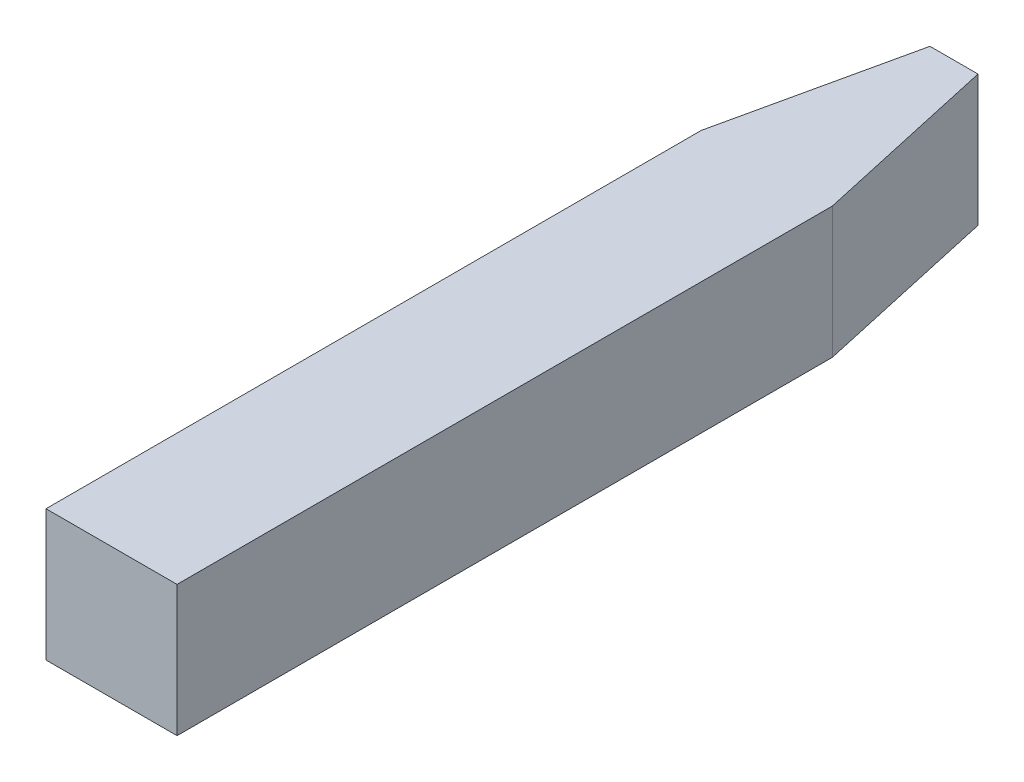
ISO-10303-21;
HEADER;
FILE_DESCRIPTION(('STEP AP214'),'2;1');
FILE_NAME('part.step','',(''),(''),'','','');
FILE_SCHEMA(('AUTOMOTIVE_DESIGN { 1 0 10303 214 1 1 1 1 }'));
ENDSEC;
DATA;
#1=APPLICATION_CONTEXT('core data for automotive mechanical design processes');
#2=APPLICATION_PROTOCOL_DEFINITION('international standard','automotive_design',2000,#1);
#3=PRODUCT_CONTEXT('',#1,'mechanical');
#4=PRODUCT('Part','Part','',(#3));
#5=PRODUCT_RELATED_PRODUCT_CATEGORY('part','',(#4));
#6=PRODUCT_DEFINITION_FORMATION('','',#4);
#7=PRODUCT_DEFINITION_CONTEXT('part definition',#1,'design');
#8=PRODUCT_DEFINITION('design','',#6,#7);
#9=PRODUCT_DEFINITION_SHAPE('','',#8);
#10=(LENGTH_UNIT() NAMED_UNIT(*) SI_UNIT(.MILLI.,.METRE.));
#11=(NAMED_UNIT(*) PLANE_ANGLE_UNIT() SI_UNIT($,.RADIAN.));
#12=(NAMED_UNIT(*) SI_UNIT($,.STERADIAN.) SOLID_ANGLE_UNIT());
#13=UNCERTAINTY_MEASURE_WITH_UNIT(LENGTH_MEASURE(1.E-05),#10,'distance_accuracy_value','');
#14=(GEOMETRIC_REPRESENTATION_CONTEXT(3) GLOBAL_UNCERTAINTY_ASSIGNED_CONTEXT((#13)) GLOBAL_UNIT_ASSIGNED_CONTEXT((#10,
#11,#12)) REPRESENTATION_CONTEXT('',''));
#15=CARTESIAN_POINT('',(0.,0.,0.));
#16=DIRECTION('',(0.,0.,1.));
#17=DIRECTION('',(1.,0.,0.));
#18=AXIS2_PLACEMENT_3D('',#15,#16,#17);
#19=CARTESIAN_POINT('',(1.46249685,2.68042,-3.61250314999995));
#20=DIRECTION('',(0.,1.,0.));
#21=DIRECTION('',(0.,0.,-1.));
#22=AXIS2_PLACEMENT_3D('',#19,#20,#21);
#23=PLANE('',#22);
#24=DIRECTION('',(-1.,0.,0.));
#25=VECTOR('',#24,1.);
#26=CARTESIAN_POINT('',(2.18,2.68042,0.999999999999105));
#27=LINE('',#26,#25);
#28=CARTESIAN_POINT('',(2.18,2.68042,0.999999999999104));
#29=VERTEX_POINT('',#28);
#30=CARTESIAN_POINT('',(1.48,2.68042,0.999999999999104));
#31=VERTEX_POINT('',#30);
#32=EDGE_CURVE('E26',#29,#31,#27,.T.);
#33=ORIENTED_EDGE('',*,*,#32,.F.);
#34=DIRECTION('',(0.,0.,1.));
#35=VECTOR('',#34,1.);
#36=CARTESIAN_POINT('',(2.18,2.68042,-2.5));
#37=LINE('',#36,#35);
#38=CARTESIAN_POINT('',(2.18,2.68042,-2.5));
#39=VERTEX_POINT('',#38);
#40=EDGE_CURVE('E131',#39,#29,#37,.T.);
#41=ORIENTED_EDGE('',*,*,#40,.F.);
#42=DIRECTION('',(0.216439613938066,0.,0.976296007119942));
#43=VECTOR('',#42,1.);
#44=CARTESIAN_POINT('',(1.95830533735709,2.68042,-3.5));
#45=LINE('',#44,#43);
#46=CARTESIAN_POINT('',(1.95830533735709,2.68042,-3.5));
#47=VERTEX_POINT('',#46);
#48=EDGE_CURVE('E118',#47,#39,#45,.T.);
#49=ORIENTED_EDGE('',*,*,#48,.F.);
#50=DIRECTION('',(1.,0.,0.));
#51=VECTOR('',#50,1.);
#52=CARTESIAN_POINT('',(1.70169466264301,2.68042,-3.5));
#53=LINE('',#52,#51);
#54=CARTESIAN_POINT('',(1.70169466264301,2.68042,-3.5));
#55=VERTEX_POINT('',#54);
#56=EDGE_CURVE('E154',#55,#47,#53,.T.);
#57=ORIENTED_EDGE('',*,*,#56,.F.);
#58=DIRECTION('',(0.216439613938066,0.,-0.976296007119942));
#59=VECTOR('',#58,1.);
#60=CARTESIAN_POINT('',(1.48,2.68042,-2.5));
#61=LINE('',#60,#59);
#62=CARTESIAN_POINT('',(1.48,2.68042,-2.5));
#63=VERTEX_POINT('',#62);
#64=EDGE_CURVE('E143',#63,#55,#61,.T.);
#65=ORIENTED_EDGE('',*,*,#64,.F.);
#66=DIRECTION('',(0.,0.,-1.));
#67=VECTOR('',#66,1.);
#68=CARTESIAN_POINT('',(1.48,2.68042,0.999999999999104));
#69=LINE('',#68,#67);
#70=EDGE_CURVE('E114',#31,#63,#69,.T.);
#71=ORIENTED_EDGE('',*,*,#70,.F.);
#72=EDGE_LOOP('',(#33,#41,#49,#57,#65,#71));
#73=FACE_BOUND('',#72,.T.);
#74=ADVANCED_FACE('F16',(#73),#23,.T.);
#75=CARTESIAN_POINT('',(1.46249685,1.98042,1.11250314999908));
#76=DIRECTION('',(0.,-1.,0.));
#77=DIRECTION('',(-1.,0.,0.));
#78=AXIS2_PLACEMENT_3D('',#75,#76,#77);
#79=PLANE('',#78);
#80=DIRECTION('',(-0.216439613938066,0.,0.976296007119942));
#81=VECTOR('',#80,1.);
#82=CARTESIAN_POINT('',(1.7016946626429,1.98042,-3.5));
#83=LINE('',#82,#81);
#84=CARTESIAN_POINT('',(1.70169466264301,1.98042,-3.5));
#85=VERTEX_POINT('',#84);
#86=CARTESIAN_POINT('',(1.48,1.98042,-2.5));
#87=VERTEX_POINT('',#86);
#88=EDGE_CURVE('E81',#85,#87,#83,.T.);
#89=ORIENTED_EDGE('',*,*,#88,.F.);
#90=DIRECTION('',(1.,0.,0.));
#91=VECTOR('',#90,1.);
#92=CARTESIAN_POINT('',(1.70169466264301,1.98042,-3.5));
#93=LINE('',#92,#91);
#94=CARTESIAN_POINT('',(1.95830533735709,1.98042,-3.5));
#95=VERTEX_POINT('',#94);
#96=EDGE_CURVE('E150',#85,#95,#93,.T.);
#97=ORIENTED_EDGE('',*,*,#96,.T.);
#98=DIRECTION('',(-0.216439613938066,0.,-0.976296007119942));
#99=VECTOR('',#98,1.);
#100=CARTESIAN_POINT('',(2.18,1.98042,-2.5));
#101=LINE('',#100,#99);
#102=CARTESIAN_POINT('',(2.18,1.98042,-2.5));
#103=VERTEX_POINT('',#102);
#104=EDGE_CURVE('E120',#103,#95,#101,.T.);
#105=ORIENTED_EDGE('',*,*,#104,.F.);
#106=DIRECTION('',(0.,0.,-1.));
#107=VECTOR('',#106,1.);
#108=CARTESIAN_POINT('',(2.18,1.98042,0.999999999999104));
#109=LINE('',#108,#107);
#110=CARTESIAN_POINT('',(2.18,1.98042,0.999999999999104));
#111=VERTEX_POINT('',#110);
#112=EDGE_CURVE('E94',#111,#103,#109,.T.);
#113=ORIENTED_EDGE('',*,*,#112,.F.);
#114=DIRECTION('',(1.,0.,0.));
#115=VECTOR('',#114,1.);
#116=CARTESIAN_POINT('',(1.48,1.98042,0.999999999999105));
#117=LINE('',#116,#115);
#118=CARTESIAN_POINT('',(1.48,1.98042,0.999999999999104));
#119=VERTEX_POINT('',#118);
#120=EDGE_CURVE('E11',#119,#111,#117,.T.);
#121=ORIENTED_EDGE('',*,*,#120,.F.);
#122=DIRECTION('',(0.,0.,1.));
#123=VECTOR('',#122,1.);
#124=CARTESIAN_POINT('',(1.48,1.98042,-2.5));
#125=LINE('',#124,#123);
#126=EDGE_CURVE('E91',#87,#119,#125,.T.);
#127=ORIENTED_EDGE('',*,*,#126,.F.);
#128=EDGE_LOOP('',(#89,#97,#105,#113,#121,#127));
#129=FACE_BOUND('',#128,.T.);
#130=ADVANCED_FACE('F89',(#129),#79,.T.);
#131=CARTESIAN_POINT('',(1.46249685,2.69792315000002,0.999999999999104));
#132=DIRECTION('',(0.,0.,-1.));
#133=DIRECTION('',(0.,-1.,0.));
#134=AXIS2_PLACEMENT_3D('',#131,#132,#133);
#135=PLANE('',#134);
#136=DIRECTION('',(0.,-1.,0.));
#137=VECTOR('',#136,1.);
#138=CARTESIAN_POINT('',(2.18,2.68042,0.999999999999104));
#139=LINE('',#138,#137);
#140=EDGE_CURVE('E121',#29,#111,#139,.T.);
#141=ORIENTED_EDGE('',*,*,#140,.F.);
#142=ORIENTED_EDGE('',*,*,#32,.T.);
#143=DIRECTION('',(0.,1.,0.));
#144=VECTOR('',#143,1.);
#145=CARTESIAN_POINT('',(1.48,1.98042,0.999999999999104));
#146=LINE('',#145,#144);
#147=EDGE_CURVE('E98',#119,#31,#146,.T.);
#148=ORIENTED_EDGE('',*,*,#147,.F.);
#149=ORIENTED_EDGE('',*,*,#120,.T.);
#150=EDGE_LOOP('',(#141,#142,#148,#149));
#151=FACE_BOUND('',#150,.T.);
#152=ADVANCED_FACE('F99',(#151),#135,.F.);
#153=CARTESIAN_POINT('',(1.95276228900624,1.96291685,-3.52500307533239));
#154=DIRECTION('',(-0.976296007119942,0.,0.216439613938066));
#155=DIRECTION('',(0.,1.,0.));
#156=AXIS2_PLACEMENT_3D('',#153,#154,#155);
#157=PLANE('',#156);
#158=ORIENTED_EDGE('',*,*,#48,.T.);
#159=DIRECTION('',(0.,-1.,0.));
#160=VECTOR('',#159,1.);
#161=CARTESIAN_POINT('',(2.18,2.68042,-2.5));
#162=LINE('',#161,#160);
#163=EDGE_CURVE('E19',#39,#103,#162,.T.);
#164=ORIENTED_EDGE('',*,*,#163,.T.);
#165=ORIENTED_EDGE('',*,*,#104,.T.);
#166=DIRECTION('',(0.,1.,0.));
#167=VECTOR('',#166,1.);
#168=CARTESIAN_POINT('',(1.95830533735709,1.98042,-3.5));
#169=LINE('',#168,#167);
#170=EDGE_CURVE('E103',#95,#47,#169,.T.);
#171=ORIENTED_EDGE('',*,*,#170,.T.);
#172=EDGE_LOOP('',(#158,#164,#165,#171));
#173=FACE_BOUND('',#172,.T.);
#174=ADVANCED_FACE('F217',(#173),#157,.F.);
#175=CARTESIAN_POINT('',(2.18,1.96291685,-2.58750314999996));
#176=DIRECTION('',(-1.,0.,0.));
#177=DIRECTION('',(0.,0.,1.));
#178=AXIS2_PLACEMENT_3D('',#175,#176,#177);
#179=PLANE('',#178);
#180=ORIENTED_EDGE('',*,*,#112,.T.);
#181=ORIENTED_EDGE('',*,*,#163,.F.);
#182=ORIENTED_EDGE('',*,*,#40,.T.);
#183=ORIENTED_EDGE('',*,*,#140,.T.);
#184=EDGE_LOOP('',(#180,#181,#182,#183));
#185=FACE_BOUND('',#184,.T.);
#186=ADVANCED_FACE('F206',(#185),#179,.F.);
#187=CARTESIAN_POINT('',(1.47445695164914,1.96291685,-2.47499692466756));
#188=DIRECTION('',(0.976296007119942,0.,0.216439613938066));
#189=DIRECTION('',(0.,-1.,0.));
#190=AXIS2_PLACEMENT_3D('',#187,#188,#189);
#191=PLANE('',#190);
#192=ORIENTED_EDGE('',*,*,#88,.T.);
#193=DIRECTION('',(0.,-1.,0.));
#194=VECTOR('',#193,1.);
#195=CARTESIAN_POINT('',(1.48,2.68042,-2.5));
#196=LINE('',#195,#194);
#197=EDGE_CURVE('E106',#63,#87,#196,.T.);
#198=ORIENTED_EDGE('',*,*,#197,.F.);
#199=ORIENTED_EDGE('',*,*,#64,.T.);
#200=DIRECTION('',(0.,-1.,0.));
#201=VECTOR('',#200,1.);
#202=CARTESIAN_POINT('',(1.70169466264301,2.68042,-3.5));
#203=LINE('',#202,#201);
#204=EDGE_CURVE('E141',#55,#85,#203,.T.);
#205=ORIENTED_EDGE('',*,*,#204,.T.);
#206=EDGE_LOOP('',(#192,#198,#199,#205));
#207=FACE_BOUND('',#206,.T.);
#208=ADVANCED_FACE('F200',(#207),#191,.F.);
#209=CARTESIAN_POINT('',(1.69527624577515,1.96291685,-3.5));
#210=DIRECTION('',(0.,0.,-1.));
#211=DIRECTION('',(0.,-1.,0.));
#212=AXIS2_PLACEMENT_3D('',#209,#210,#211);
#213=PLANE('',#212);
#214=ORIENTED_EDGE('',*,*,#170,.F.);
#215=ORIENTED_EDGE('',*,*,#96,.F.);
#216=ORIENTED_EDGE('',*,*,#204,.F.);
#217=ORIENTED_EDGE('',*,*,#56,.T.);
#218=EDGE_LOOP('',(#214,#215,#216,#217));
#219=FACE_BOUND('',#218,.T.);
#220=ADVANCED_FACE('F205',(#219),#213,.T.);
#221=CARTESIAN_POINT('',(1.48,1.96291685000001,1.08750314999908));
#222=DIRECTION('',(1.,0.,0.));
#223=DIRECTION('',(0.,0.,1.));
#224=AXIS2_PLACEMENT_3D('',#221,#222,#223);
#225=PLANE('',#224);
#226=ORIENTED_EDGE('',*,*,#70,.T.);
#227=ORIENTED_EDGE('',*,*,#197,.T.);
#228=ORIENTED_EDGE('',*,*,#126,.T.);
#229=ORIENTED_EDGE('',*,*,#147,.T.);
#230=EDGE_LOOP('',(#226,#227,#228,#229));
#231=FACE_BOUND('',#230,.T.);
#232=ADVANCED_FACE('F105',(#231),#225,.F.);
#233=CLOSED_SHELL('',(#74,#130,#152,#174,#186,#208,#220,#232));
#234=MANIFOLD_SOLID_BREP('B1',#233);
#235=ADVANCED_BREP_SHAPE_REPRESENTATION('',(#18,#234),#14);
#236=SHAPE_DEFINITION_REPRESENTATION(#9,#235);
ENDSEC;
END-ISO-10303-21;
